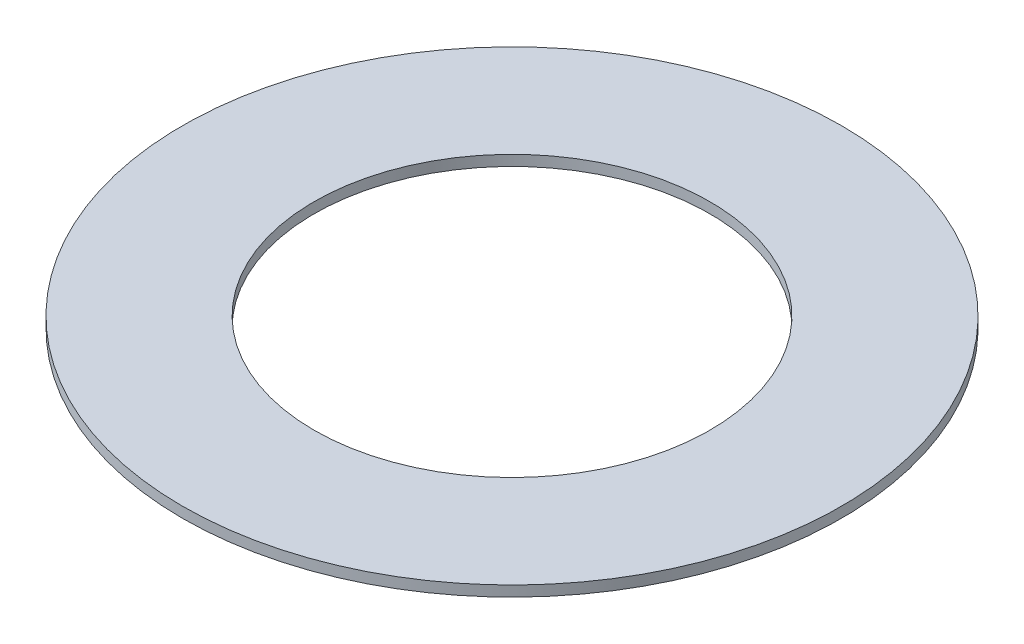
ISO-10303-21;
HEADER;
FILE_DESCRIPTION(('STEP AP214'),'2;1');
FILE_NAME('part.step','',(''),(''),'','','');
FILE_SCHEMA(('AUTOMOTIVE_DESIGN { 1 0 10303 214 1 1 1 1 }'));
ENDSEC;
DATA;
#1=APPLICATION_CONTEXT('core data for automotive mechanical design processes');
#2=APPLICATION_PROTOCOL_DEFINITION('international standard','automotive_design',2000,#1);
#3=PRODUCT_CONTEXT('',#1,'mechanical');
#4=PRODUCT('Part','Part','',(#3));
#5=PRODUCT_RELATED_PRODUCT_CATEGORY('part','',(#4));
#6=PRODUCT_DEFINITION_FORMATION('','',#4);
#7=PRODUCT_DEFINITION_CONTEXT('part definition',#1,'design');
#8=PRODUCT_DEFINITION('design','',#6,#7);
#9=PRODUCT_DEFINITION_SHAPE('','',#8);
#10=(LENGTH_UNIT() NAMED_UNIT(*) SI_UNIT(.MILLI.,.METRE.));
#11=(NAMED_UNIT(*) PLANE_ANGLE_UNIT() SI_UNIT($,.RADIAN.));
#12=(NAMED_UNIT(*) SI_UNIT($,.STERADIAN.) SOLID_ANGLE_UNIT());
#13=UNCERTAINTY_MEASURE_WITH_UNIT(LENGTH_MEASURE(1.E-05),#10,'distance_accuracy_value','');
#14=(GEOMETRIC_REPRESENTATION_CONTEXT(3) GLOBAL_UNCERTAINTY_ASSIGNED_CONTEXT((#13)) GLOBAL_UNIT_ASSIGNED_CONTEXT((#10,
#11,#12)) REPRESENTATION_CONTEXT('',''));
#15=CARTESIAN_POINT('',(0.,0.,0.));
#16=DIRECTION('',(0.,0.,1.));
#17=DIRECTION('',(1.,0.,0.));
#18=AXIS2_PLACEMENT_3D('',#15,#16,#17);
#19=CARTESIAN_POINT('',(0.,0.127000000000002,0.));
#20=DIRECTION('',(0.,1.,0.));
#21=DIRECTION('',(0.,0.,1.));
#22=AXIS2_PLACEMENT_3D('',#19,#20,#21);
#23=PLANE('',#22);
#24=CARTESIAN_POINT('',(0.,0.127000000000002,0.));
#25=DIRECTION('',(0.,1.,0.));
#26=DIRECTION('',(0.,0.,1.));
#27=AXIS2_PLACEMENT_3D('',#24,#25,#26);
#28=CIRCLE('',#27,3.9751);
#29=CARTESIAN_POINT('',(0.,0.127000000000002,3.9751));
#30=VERTEX_POINT('',#29);
#31=EDGE_CURVE('E10',#30,#30,#28,.T.);
#32=ORIENTED_EDGE('',*,*,#31,.T.);
#33=EDGE_LOOP('',(#32));
#34=FACE_BOUND('',#33,.T.);
#35=CARTESIAN_POINT('',(0.,0.127000000000002,0.));
#36=DIRECTION('',(0.,1.,0.));
#37=DIRECTION('',(0.,0.,1.));
#38=AXIS2_PLACEMENT_3D('',#35,#36,#37);
#39=CIRCLE('',#38,2.3876);
#40=CARTESIAN_POINT('',(0.,0.127000000000002,2.3876));
#41=VERTEX_POINT('',#40);
#42=EDGE_CURVE('E41',#41,#41,#39,.T.);
#43=ORIENTED_EDGE('',*,*,#42,.F.);
#44=EDGE_LOOP('',(#43));
#45=FACE_BOUND('',#44,.T.);
#46=ADVANCED_FACE('F30',(#34,#45),#23,.T.);
#47=CARTESIAN_POINT('',(0.,0.,0.));
#48=DIRECTION('',(0.,1.,0.));
#49=DIRECTION('',(0.,0.,1.));
#50=AXIS2_PLACEMENT_3D('',#47,#48,#49);
#51=PLANE('',#50);
#52=CARTESIAN_POINT('',(0.,0.,0.));
#53=DIRECTION('',(0.,1.,0.));
#54=DIRECTION('',(0.,0.,1.));
#55=AXIS2_PLACEMENT_3D('',#52,#53,#54);
#56=CIRCLE('',#55,3.9751);
#57=CARTESIAN_POINT('',(0.,0.,3.9751));
#58=VERTEX_POINT('',#57);
#59=EDGE_CURVE('E34',#58,#58,#56,.T.);
#60=ORIENTED_EDGE('',*,*,#59,.F.);
#61=EDGE_LOOP('',(#60));
#62=FACE_BOUND('',#61,.T.);
#63=CARTESIAN_POINT('',(0.,0.,0.));
#64=DIRECTION('',(0.,1.,0.));
#65=DIRECTION('',(0.,0.,1.));
#66=AXIS2_PLACEMENT_3D('',#63,#64,#65);
#67=CIRCLE('',#66,2.3876);
#68=CARTESIAN_POINT('',(0.,0.,2.3876));
#69=VERTEX_POINT('',#68);
#70=EDGE_CURVE('E43',#69,#69,#67,.T.);
#71=ORIENTED_EDGE('',*,*,#70,.T.);
#72=EDGE_LOOP('',(#71));
#73=FACE_BOUND('',#72,.T.);
#74=ADVANCED_FACE('F53',(#62,#73),#51,.F.);
#75=CARTESIAN_POINT('',(0.,0.127000000000002,0.));
#76=DIRECTION('',(0.,-1.,0.));
#77=DIRECTION('',(0.,0.,-1.));
#78=AXIS2_PLACEMENT_3D('',#75,#76,#77);
#79=CYLINDRICAL_SURFACE('',#78,3.9751);
#80=ORIENTED_EDGE('',*,*,#31,.F.);
#81=EDGE_LOOP('',(#80));
#82=FACE_BOUND('',#81,.T.);
#83=ORIENTED_EDGE('',*,*,#59,.T.);
#84=EDGE_LOOP('',(#83));
#85=FACE_BOUND('',#84,.T.);
#86=ADVANCED_FACE('F32',(#82,#85),#79,.T.);
#87=CARTESIAN_POINT('',(0.,0.127000000000002,0.));
#88=DIRECTION('',(0.,-1.,0.));
#89=DIRECTION('',(0.,0.,-1.));
#90=AXIS2_PLACEMENT_3D('',#87,#88,#89);
#91=CYLINDRICAL_SURFACE('',#90,2.3876);
#92=ORIENTED_EDGE('',*,*,#42,.T.);
#93=EDGE_LOOP('',(#92));
#94=FACE_BOUND('',#93,.T.);
#95=ORIENTED_EDGE('',*,*,#70,.F.);
#96=EDGE_LOOP('',(#95));
#97=FACE_BOUND('',#96,.T.);
#98=ADVANCED_FACE('F49',(#94,#97),#91,.F.);
#99=CLOSED_SHELL('',(#46,#74,#86,#98));
#100=MANIFOLD_SOLID_BREP('B2',#99);
#101=ADVANCED_BREP_SHAPE_REPRESENTATION('',(#18,#100),#14);
#102=SHAPE_DEFINITION_REPRESENTATION(#9,#101);
ENDSEC;
END-ISO-10303-21;
